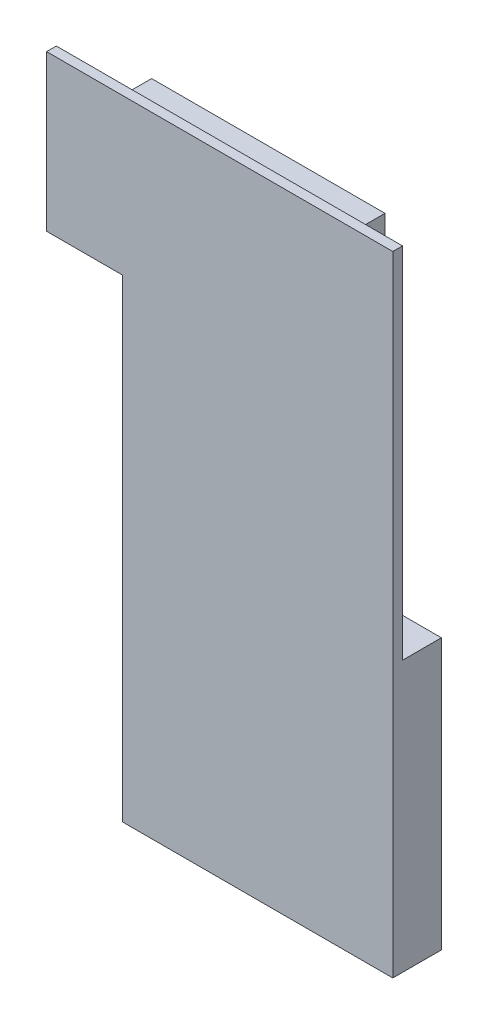
ISO-10303-21;
HEADER;
FILE_DESCRIPTION(('STEP AP214'),'2;1');
FILE_NAME('part.step','',(''),(''),'','','');
FILE_SCHEMA(('AUTOMOTIVE_DESIGN { 1 0 10303 214 1 1 1 1 }'));
ENDSEC;
DATA;
#1=APPLICATION_CONTEXT('core data for automotive mechanical design processes');
#2=APPLICATION_PROTOCOL_DEFINITION('international standard','automotive_design',2000,#1);
#3=PRODUCT_CONTEXT('',#1,'mechanical');
#4=PRODUCT('Part','Part','',(#3));
#5=PRODUCT_RELATED_PRODUCT_CATEGORY('part','',(#4));
#6=PRODUCT_DEFINITION_FORMATION('','',#4);
#7=PRODUCT_DEFINITION_CONTEXT('part definition',#1,'design');
#8=PRODUCT_DEFINITION('design','',#6,#7);
#9=PRODUCT_DEFINITION_SHAPE('','',#8);
#10=(LENGTH_UNIT() NAMED_UNIT(*) SI_UNIT(.MILLI.,.METRE.));
#11=(NAMED_UNIT(*) PLANE_ANGLE_UNIT() SI_UNIT($,.RADIAN.));
#12=(NAMED_UNIT(*) SI_UNIT($,.STERADIAN.) SOLID_ANGLE_UNIT());
#13=UNCERTAINTY_MEASURE_WITH_UNIT(LENGTH_MEASURE(1.E-05),#10,'distance_accuracy_value','');
#14=(GEOMETRIC_REPRESENTATION_CONTEXT(3) GLOBAL_UNCERTAINTY_ASSIGNED_CONTEXT((#13)) GLOBAL_UNIT_ASSIGNED_CONTEXT((#10,
#11,#12)) REPRESENTATION_CONTEXT('',''));
#15=CARTESIAN_POINT('',(0.,0.,0.));
#16=DIRECTION('',(0.,0.,1.));
#17=DIRECTION('',(1.,0.,0.));
#18=AXIS2_PLACEMENT_3D('',#15,#16,#17);
#19=CARTESIAN_POINT('',(0.,0.,-1.));
#20=DIRECTION('',(0.,0.,-1.));
#21=DIRECTION('',(0.,-1.,0.));
#22=AXIS2_PLACEMENT_3D('',#19,#20,#21);
#23=PLANE('',#22);
#24=DIRECTION('',(0.,1.,0.));
#25=VECTOR('',#24,1.);
#26=CARTESIAN_POINT('',(-3.475,-3.475,-1.));
#27=LINE('',#26,#25);
#28=CARTESIAN_POINT('',(-3.475,-3.475,-1.));
#29=VERTEX_POINT('',#28);
#30=CARTESIAN_POINT('',(-3.475,3.475,-1.));
#31=VERTEX_POINT('',#30);
#32=EDGE_CURVE('E11',#29,#31,#27,.T.);
#33=ORIENTED_EDGE('',*,*,#32,.T.);
#34=DIRECTION('',(1.,0.,0.));
#35=VECTOR('',#34,1.);
#36=CARTESIAN_POINT('',(-3.475,3.475,-1.));
#37=LINE('',#36,#35);
#38=CARTESIAN_POINT('',(3.475,3.475,-1.));
#39=VERTEX_POINT('',#38);
#40=EDGE_CURVE('E47',#31,#39,#37,.T.);
#41=ORIENTED_EDGE('',*,*,#40,.T.);
#42=DIRECTION('',(0.,-1.,0.));
#43=VECTOR('',#42,1.);
#44=CARTESIAN_POINT('',(3.475,3.475,-1.));
#45=LINE('',#44,#43);
#46=CARTESIAN_POINT('',(3.475,-3.475,-1.));
#47=VERTEX_POINT('',#46);
#48=EDGE_CURVE('E211',#39,#47,#45,.T.);
#49=ORIENTED_EDGE('',*,*,#48,.T.);
#50=DIRECTION('',(-1.,0.,0.));
#51=VECTOR('',#50,1.);
#52=CARTESIAN_POINT('',(3.475,-3.475,-1.));
#53=LINE('',#52,#51);
#54=EDGE_CURVE('E198',#47,#29,#53,.T.);
#55=ORIENTED_EDGE('',*,*,#54,.T.);
#56=EDGE_LOOP('',(#33,#41,#49,#55));
#57=FACE_BOUND('',#56,.T.);
#58=ADVANCED_FACE('F16',(#57),#23,.T.);
#59=CARTESIAN_POINT('',(2.025,9.2,0.));
#60=DIRECTION('',(0.,-1.,0.));
#61=DIRECTION('',(-1.,0.,0.));
#62=AXIS2_PLACEMENT_3D('',#59,#60,#61);
#63=PLANE('',#62);
#64=DIRECTION('',(-1.,0.,0.));
#65=VECTOR('',#64,1.);
#66=CARTESIAN_POINT('',(2.025,9.2,0.));
#67=LINE('',#66,#65);
#68=CARTESIAN_POINT('',(2.025,9.2,0.));
#69=VERTEX_POINT('',#68);
#70=CARTESIAN_POINT('',(-3.975,9.2,0.));
#71=VERTEX_POINT('',#70);
#72=EDGE_CURVE('E214',#69,#71,#67,.T.);
#73=ORIENTED_EDGE('',*,*,#72,.T.);
#74=DIRECTION('',(0.,0.,-1.));
#75=VECTOR('',#74,1.);
#76=CARTESIAN_POINT('',(-3.975,9.2,0.));
#77=LINE('',#76,#75);
#78=CARTESIAN_POINT('',(-3.975,9.2,-1.));
#79=VERTEX_POINT('',#78);
#80=EDGE_CURVE('E180',#71,#79,#77,.T.);
#81=ORIENTED_EDGE('',*,*,#80,.T.);
#82=DIRECTION('',(-1.,0.,0.));
#83=VECTOR('',#82,1.);
#84=CARTESIAN_POINT('',(2.025,9.2,-1.));
#85=LINE('',#84,#83);
#86=CARTESIAN_POINT('',(2.025,9.2,-1.));
#87=VERTEX_POINT('',#86);
#88=EDGE_CURVE('E234',#87,#79,#85,.T.);
#89=ORIENTED_EDGE('',*,*,#88,.F.);
#90=DIRECTION('',(0.,0.,-1.));
#91=VECTOR('',#90,1.);
#92=CARTESIAN_POINT('',(2.025,9.2,0.));
#93=LINE('',#92,#91);
#94=EDGE_CURVE('E208',#69,#87,#93,.T.);
#95=ORIENTED_EDGE('',*,*,#94,.F.);
#96=EDGE_LOOP('',(#73,#81,#89,#95));
#97=FACE_BOUND('',#96,.T.);
#98=ADVANCED_FACE('F288',(#97),#63,.T.);
#99=CARTESIAN_POINT('',(-3.475,-3.475,0.));
#100=DIRECTION('',(-1.,0.,0.));
#101=DIRECTION('',(0.,1.,0.));
#102=AXIS2_PLACEMENT_3D('',#99,#100,#101);
#103=PLANE('',#102);
#104=DIRECTION('',(0.,0.,-1.));
#105=VECTOR('',#104,1.);
#106=CARTESIAN_POINT('',(-3.475,3.475,0.));
#107=LINE('',#106,#105);
#108=CARTESIAN_POINT('',(-3.475,3.475,0.));
#109=VERTEX_POINT('',#108);
#110=EDGE_CURVE('E26',#109,#31,#107,.T.);
#111=ORIENTED_EDGE('',*,*,#110,.T.);
#112=ORIENTED_EDGE('',*,*,#32,.F.);
#113=DIRECTION('',(0.,0.,1.));
#114=VECTOR('',#113,1.);
#115=CARTESIAN_POINT('',(-3.475,-3.475,0.));
#116=LINE('',#115,#114);
#117=CARTESIAN_POINT('',(-3.475,-3.475,0.25));
#118=VERTEX_POINT('',#117);
#119=EDGE_CURVE('E152',#29,#118,#116,.T.);
#120=ORIENTED_EDGE('',*,*,#119,.T.);
#121=DIRECTION('',(0.,-1.,0.));
#122=VECTOR('',#121,1.);
#123=CARTESIAN_POINT('',(-3.475,8.7,0.25));
#124=LINE('',#123,#122);
#125=CARTESIAN_POINT('',(-3.475,8.7,0.25));
#126=VERTEX_POINT('',#125);
#127=EDGE_CURVE('E144',#126,#118,#124,.T.);
#128=ORIENTED_EDGE('',*,*,#127,.F.);
#129=DIRECTION('',(0.,0.,1.));
#130=VECTOR('',#129,1.);
#131=CARTESIAN_POINT('',(-3.475,8.7,0.));
#132=LINE('',#131,#130);
#133=CARTESIAN_POINT('',(-3.475,8.7,0.));
#134=VERTEX_POINT('',#133);
#135=EDGE_CURVE('E149',#134,#126,#132,.T.);
#136=ORIENTED_EDGE('',*,*,#135,.F.);
#137=DIRECTION('',(0.,-1.,0.));
#138=VECTOR('',#137,1.);
#139=CARTESIAN_POINT('',(-3.475,8.7,0.));
#140=LINE('',#139,#138);
#141=EDGE_CURVE('E252',#134,#109,#140,.T.);
#142=ORIENTED_EDGE('',*,*,#141,.T.);
#143=EDGE_LOOP('',(#111,#112,#120,#128,#136,#142));
#144=FACE_BOUND('',#143,.T.);
#145=ADVANCED_FACE('F146',(#144),#103,.T.);
#146=CARTESIAN_POINT('',(-3.475,3.475,0.));
#147=DIRECTION('',(0.,1.,0.));
#148=DIRECTION('',(1.,0.,0.));
#149=AXIS2_PLACEMENT_3D('',#146,#147,#148);
#150=PLANE('',#149);
#151=DIRECTION('',(1.,0.,0.));
#152=VECTOR('',#151,1.);
#153=CARTESIAN_POINT('',(-3.475,3.475,0.));
#154=LINE('',#153,#152);
#155=CARTESIAN_POINT('',(3.475,3.475,0.));
#156=VERTEX_POINT('',#155);
#157=EDGE_CURVE('E191',#109,#156,#154,.T.);
#158=ORIENTED_EDGE('',*,*,#157,.T.);
#159=DIRECTION('',(0.,0.,-1.));
#160=VECTOR('',#159,1.);
#161=CARTESIAN_POINT('',(3.475,3.475,0.));
#162=LINE('',#161,#160);
#163=EDGE_CURVE('E123',#156,#39,#162,.T.);
#164=ORIENTED_EDGE('',*,*,#163,.T.);
#165=ORIENTED_EDGE('',*,*,#40,.F.);
#166=ORIENTED_EDGE('',*,*,#110,.F.);
#167=EDGE_LOOP('',(#158,#164,#165,#166));
#168=FACE_BOUND('',#167,.T.);
#169=ADVANCED_FACE('F306',(#168),#150,.T.);
#170=CARTESIAN_POINT('',(2.025,12.2,0.));
#171=DIRECTION('',(1.,0.,0.));
#172=DIRECTION('',(0.,1.,0.));
#173=AXIS2_PLACEMENT_3D('',#170,#171,#172);
#174=PLANE('',#173);
#175=DIRECTION('',(0.,-1.,0.));
#176=VECTOR('',#175,1.);
#177=CARTESIAN_POINT('',(2.025,12.2,0.));
#178=LINE('',#177,#176);
#179=CARTESIAN_POINT('',(2.025,12.2,0.));
#180=VERTEX_POINT('',#179);
#181=EDGE_CURVE('E215',#180,#69,#178,.T.);
#182=ORIENTED_EDGE('',*,*,#181,.T.);
#183=ORIENTED_EDGE('',*,*,#94,.T.);
#184=DIRECTION('',(0.,-1.,0.));
#185=VECTOR('',#184,1.);
#186=CARTESIAN_POINT('',(2.025,12.2,-1.));
#187=LINE('',#186,#185);
#188=CARTESIAN_POINT('',(2.025,12.2,-1.));
#189=VERTEX_POINT('',#188);
#190=EDGE_CURVE('E223',#189,#87,#187,.T.);
#191=ORIENTED_EDGE('',*,*,#190,.F.);
#192=DIRECTION('',(0.,0.,-1.));
#193=VECTOR('',#192,1.);
#194=CARTESIAN_POINT('',(2.025,12.2,0.));
#195=LINE('',#194,#193);
#196=EDGE_CURVE('E188',#180,#189,#195,.T.);
#197=ORIENTED_EDGE('',*,*,#196,.F.);
#198=EDGE_LOOP('',(#182,#183,#191,#197));
#199=FACE_BOUND('',#198,.T.);
#200=ADVANCED_FACE('F303',(#199),#174,.T.);
#201=CARTESIAN_POINT('',(3.475,3.475,0.));
#202=DIRECTION('',(1.,0.,0.));
#203=DIRECTION('',(0.,1.,0.));
#204=AXIS2_PLACEMENT_3D('',#201,#202,#203);
#205=PLANE('',#204);
#206=DIRECTION('',(0.,0.,1.));
#207=VECTOR('',#206,1.);
#208=CARTESIAN_POINT('',(3.475,-3.475,0.));
#209=LINE('',#208,#207);
#210=CARTESIAN_POINT('',(3.475,-3.475,0.25));
#211=VERTEX_POINT('',#210);
#212=EDGE_CURVE('E201',#47,#211,#209,.T.);
#213=ORIENTED_EDGE('',*,*,#212,.F.);
#214=ORIENTED_EDGE('',*,*,#48,.F.);
#215=ORIENTED_EDGE('',*,*,#163,.F.);
#216=DIRECTION('',(0.,-1.,0.));
#217=VECTOR('',#216,1.);
#218=CARTESIAN_POINT('',(3.475,3.475,0.));
#219=LINE('',#218,#217);
#220=CARTESIAN_POINT('',(3.475,12.7,0.));
#221=VERTEX_POINT('',#220);
#222=EDGE_CURVE('E196',#221,#156,#219,.T.);
#223=ORIENTED_EDGE('',*,*,#222,.F.);
#224=DIRECTION('',(0.,0.,1.));
#225=VECTOR('',#224,1.);
#226=CARTESIAN_POINT('',(3.475,12.7,0.));
#227=LINE('',#226,#225);
#228=CARTESIAN_POINT('',(3.475,12.7,0.25));
#229=VERTEX_POINT('',#228);
#230=EDGE_CURVE('E238',#221,#229,#227,.T.);
#231=ORIENTED_EDGE('',*,*,#230,.T.);
#232=DIRECTION('',(0.,1.,0.));
#233=VECTOR('',#232,1.);
#234=CARTESIAN_POINT('',(3.475,3.475,0.25));
#235=LINE('',#234,#233);
#236=EDGE_CURVE('E157',#211,#229,#235,.T.);
#237=ORIENTED_EDGE('',*,*,#236,.F.);
#238=EDGE_LOOP('',(#213,#214,#215,#223,#231,#237));
#239=FACE_BOUND('',#238,.T.);
#240=ADVANCED_FACE('F305',(#239),#205,.T.);
#241=CARTESIAN_POINT('',(-0.975,4.6125,0.25));
#242=DIRECTION('',(0.,0.,1.));
#243=DIRECTION('',(1.,0.,0.));
#244=AXIS2_PLACEMENT_3D('',#241,#242,#243);
#245=PLANE('',#244);
#246=ORIENTED_EDGE('',*,*,#127,.T.);
#247=DIRECTION('',(1.,0.,0.));
#248=VECTOR('',#247,1.);
#249=CARTESIAN_POINT('',(3.475,-3.475,0.25));
#250=LINE('',#249,#248);
#251=EDGE_CURVE('E158',#118,#211,#250,.T.);
#252=ORIENTED_EDGE('',*,*,#251,.T.);
#253=ORIENTED_EDGE('',*,*,#236,.T.);
#254=DIRECTION('',(-1.,0.,0.));
#255=VECTOR('',#254,1.);
#256=CARTESIAN_POINT('',(-5.425,12.7,0.25));
#257=LINE('',#256,#255);
#258=CARTESIAN_POINT('',(-5.425,12.7,0.25));
#259=VERTEX_POINT('',#258);
#260=EDGE_CURVE('E242',#229,#259,#257,.T.);
#261=ORIENTED_EDGE('',*,*,#260,.T.);
#262=DIRECTION('',(0.,-1.,0.));
#263=VECTOR('',#262,1.);
#264=CARTESIAN_POINT('',(-5.425,8.7,0.25));
#265=LINE('',#264,#263);
#266=CARTESIAN_POINT('',(-5.425,8.7,0.25));
#267=VERTEX_POINT('',#266);
#268=EDGE_CURVE('E163',#259,#267,#265,.T.);
#269=ORIENTED_EDGE('',*,*,#268,.T.);
#270=DIRECTION('',(1.,0.,0.));
#271=VECTOR('',#270,1.);
#272=CARTESIAN_POINT('',(3.475,8.7,0.25));
#273=LINE('',#272,#271);
#274=EDGE_CURVE('E20',#267,#126,#273,.T.);
#275=ORIENTED_EDGE('',*,*,#274,.T.);
#276=EDGE_LOOP('',(#246,#252,#253,#261,#269,#275));
#277=FACE_BOUND('',#276,.T.);
#278=ADVANCED_FACE('F161',(#277),#245,.T.);
#279=CARTESIAN_POINT('',(3.475,-3.475,0.));
#280=DIRECTION('',(0.,-1.,0.));
#281=DIRECTION('',(0.,0.,-1.));
#282=AXIS2_PLACEMENT_3D('',#279,#280,#281);
#283=PLANE('',#282);
#284=ORIENTED_EDGE('',*,*,#119,.F.);
#285=ORIENTED_EDGE('',*,*,#54,.F.);
#286=ORIENTED_EDGE('',*,*,#212,.T.);
#287=ORIENTED_EDGE('',*,*,#251,.F.);
#288=EDGE_LOOP('',(#284,#285,#286,#287));
#289=FACE_BOUND('',#288,.T.);
#290=ADVANCED_FACE('F334',(#289),#283,.T.);
#291=CARTESIAN_POINT('',(-5.425,12.7,0.));
#292=DIRECTION('',(-1.,0.,0.));
#293=DIRECTION('',(0.,0.,1.));
#294=AXIS2_PLACEMENT_3D('',#291,#292,#293);
#295=PLANE('',#294);
#296=DIRECTION('',(0.,1.,0.));
#297=VECTOR('',#296,1.);
#298=CARTESIAN_POINT('',(-5.425,8.7,0.));
#299=LINE('',#298,#297);
#300=CARTESIAN_POINT('',(-5.425,8.7,0.));
#301=VERTEX_POINT('',#300);
#302=CARTESIAN_POINT('',(-5.425,12.7,0.));
#303=VERTEX_POINT('',#302);
#304=EDGE_CURVE('E197',#301,#303,#299,.T.);
#305=ORIENTED_EDGE('',*,*,#304,.F.);
#306=DIRECTION('',(0.,0.,1.));
#307=VECTOR('',#306,1.);
#308=CARTESIAN_POINT('',(-5.425,8.7,0.));
#309=LINE('',#308,#307);
#310=EDGE_CURVE('E168',#301,#267,#309,.T.);
#311=ORIENTED_EDGE('',*,*,#310,.T.);
#312=ORIENTED_EDGE('',*,*,#268,.F.);
#313=DIRECTION('',(0.,0.,1.));
#314=VECTOR('',#313,1.);
#315=CARTESIAN_POINT('',(-5.425,12.7,0.));
#316=LINE('',#315,#314);
#317=EDGE_CURVE('E133',#303,#259,#316,.T.);
#318=ORIENTED_EDGE('',*,*,#317,.F.);
#319=EDGE_LOOP('',(#305,#311,#312,#318));
#320=FACE_BOUND('',#319,.T.);
#321=ADVANCED_FACE('F327',(#320),#295,.T.);
#322=CARTESIAN_POINT('',(3.475,12.7,0.));
#323=DIRECTION('',(0.,1.,0.));
#324=DIRECTION('',(1.,0.,0.));
#325=AXIS2_PLACEMENT_3D('',#322,#323,#324);
#326=PLANE('',#325);
#327=DIRECTION('',(1.,0.,0.));
#328=VECTOR('',#327,1.);
#329=CARTESIAN_POINT('',(-5.425,12.7,0.));
#330=LINE('',#329,#328);
#331=EDGE_CURVE('E192',#303,#221,#330,.T.);
#332=ORIENTED_EDGE('',*,*,#331,.F.);
#333=ORIENTED_EDGE('',*,*,#317,.T.);
#334=ORIENTED_EDGE('',*,*,#260,.F.);
#335=ORIENTED_EDGE('',*,*,#230,.F.);
#336=EDGE_LOOP('',(#332,#333,#334,#335));
#337=FACE_BOUND('',#336,.T.);
#338=ADVANCED_FACE('F325',(#337),#326,.T.);
#339=CARTESIAN_POINT('',(-0.975,4.6125,0.));
#340=DIRECTION('',(0.,0.,1.));
#341=DIRECTION('',(1.,0.,0.));
#342=AXIS2_PLACEMENT_3D('',#339,#340,#341);
#343=PLANE('',#342);
#344=DIRECTION('',(0.,1.,0.));
#345=VECTOR('',#344,1.);
#346=CARTESIAN_POINT('',(-3.975,9.2,0.));
#347=LINE('',#346,#345);
#348=CARTESIAN_POINT('',(-3.975,12.2,0.));
#349=VERTEX_POINT('',#348);
#350=EDGE_CURVE('E187',#71,#349,#347,.T.);
#351=ORIENTED_EDGE('',*,*,#350,.F.);
#352=ORIENTED_EDGE('',*,*,#72,.F.);
#353=ORIENTED_EDGE('',*,*,#181,.F.);
#354=DIRECTION('',(1.,0.,0.));
#355=VECTOR('',#354,1.);
#356=CARTESIAN_POINT('',(-3.975,12.2,0.));
#357=LINE('',#356,#355);
#358=EDGE_CURVE('E226',#349,#180,#357,.T.);
#359=ORIENTED_EDGE('',*,*,#358,.F.);
#360=EDGE_LOOP('',(#351,#352,#353,#359));
#361=FACE_BOUND('',#360,.T.);
#362=ORIENTED_EDGE('',*,*,#157,.F.);
#363=ORIENTED_EDGE('',*,*,#141,.F.);
#364=DIRECTION('',(-1.,0.,0.));
#365=VECTOR('',#364,1.);
#366=CARTESIAN_POINT('',(3.475,8.7,0.));
#367=LINE('',#366,#365);
#368=EDGE_CURVE('E171',#134,#301,#367,.T.);
#369=ORIENTED_EDGE('',*,*,#368,.T.);
#370=ORIENTED_EDGE('',*,*,#304,.T.);
#371=ORIENTED_EDGE('',*,*,#331,.T.);
#372=ORIENTED_EDGE('',*,*,#222,.T.);
#373=EDGE_LOOP('',(#362,#363,#369,#370,#371,#372));
#374=FACE_BOUND('',#373,.T.);
#375=ADVANCED_FACE('F299',(#361,#374),#343,.F.);
#376=CARTESIAN_POINT('',(-5.425,8.7,0.));
#377=DIRECTION('',(0.,-1.,0.));
#378=DIRECTION('',(0.,0.,-1.));
#379=AXIS2_PLACEMENT_3D('',#376,#377,#378);
#380=PLANE('',#379);
#381=ORIENTED_EDGE('',*,*,#368,.F.);
#382=ORIENTED_EDGE('',*,*,#135,.T.);
#383=ORIENTED_EDGE('',*,*,#274,.F.);
#384=ORIENTED_EDGE('',*,*,#310,.F.);
#385=EDGE_LOOP('',(#381,#382,#383,#384));
#386=FACE_BOUND('',#385,.T.);
#387=ADVANCED_FACE('F169',(#386),#380,.T.);
#388=CARTESIAN_POINT('',(-3.975,9.2,0.));
#389=DIRECTION('',(-1.,0.,0.));
#390=DIRECTION('',(0.,1.,0.));
#391=AXIS2_PLACEMENT_3D('',#388,#389,#390);
#392=PLANE('',#391);
#393=ORIENTED_EDGE('',*,*,#350,.T.);
#394=DIRECTION('',(0.,0.,-1.));
#395=VECTOR('',#394,1.);
#396=CARTESIAN_POINT('',(-3.975,12.2,0.));
#397=LINE('',#396,#395);
#398=CARTESIAN_POINT('',(-3.975,12.2,-1.));
#399=VERTEX_POINT('',#398);
#400=EDGE_CURVE('E185',#349,#399,#397,.T.);
#401=ORIENTED_EDGE('',*,*,#400,.T.);
#402=DIRECTION('',(0.,1.,0.));
#403=VECTOR('',#402,1.);
#404=CARTESIAN_POINT('',(-3.975,9.2,-1.));
#405=LINE('',#404,#403);
#406=EDGE_CURVE('E230',#79,#399,#405,.T.);
#407=ORIENTED_EDGE('',*,*,#406,.F.);
#408=ORIENTED_EDGE('',*,*,#80,.F.);
#409=EDGE_LOOP('',(#393,#401,#407,#408));
#410=FACE_BOUND('',#409,.T.);
#411=ADVANCED_FACE('F293',(#410),#392,.T.);
#412=CARTESIAN_POINT('',(-3.975,12.2,0.));
#413=DIRECTION('',(0.,1.,0.));
#414=DIRECTION('',(1.,0.,0.));
#415=AXIS2_PLACEMENT_3D('',#412,#413,#414);
#416=PLANE('',#415);
#417=ORIENTED_EDGE('',*,*,#358,.T.);
#418=ORIENTED_EDGE('',*,*,#196,.T.);
#419=DIRECTION('',(1.,0.,0.));
#420=VECTOR('',#419,1.);
#421=CARTESIAN_POINT('',(-3.975,12.2,-1.));
#422=LINE('',#421,#420);
#423=EDGE_CURVE('E219',#399,#189,#422,.T.);
#424=ORIENTED_EDGE('',*,*,#423,.F.);
#425=ORIENTED_EDGE('',*,*,#400,.F.);
#426=EDGE_LOOP('',(#417,#418,#424,#425));
#427=FACE_BOUND('',#426,.T.);
#428=ADVANCED_FACE('F18',(#427),#416,.T.);
#429=CARTESIAN_POINT('',(-0.975,10.7,-1.));
#430=DIRECTION('',(0.,0.,-1.));
#431=DIRECTION('',(0.,-1.,0.));
#432=AXIS2_PLACEMENT_3D('',#429,#430,#431);
#433=PLANE('',#432);
#434=ORIENTED_EDGE('',*,*,#423,.T.);
#435=ORIENTED_EDGE('',*,*,#190,.T.);
#436=ORIENTED_EDGE('',*,*,#88,.T.);
#437=ORIENTED_EDGE('',*,*,#406,.T.);
#438=EDGE_LOOP('',(#434,#435,#436,#437));
#439=FACE_BOUND('',#438,.T.);
#440=ADVANCED_FACE('F283',(#439),#433,.T.);
#441=CLOSED_SHELL('',(#58,#98,#145,#169,#200,#240,#278,#290,#321,#338,#375,#387,#411,#428,#440));
#442=MANIFOLD_SOLID_BREP('B1',#441);
#443=ADVANCED_BREP_SHAPE_REPRESENTATION('',(#18,#442),#14);
#444=SHAPE_DEFINITION_REPRESENTATION(#9,#443);
ENDSEC;
END-ISO-10303-21;
